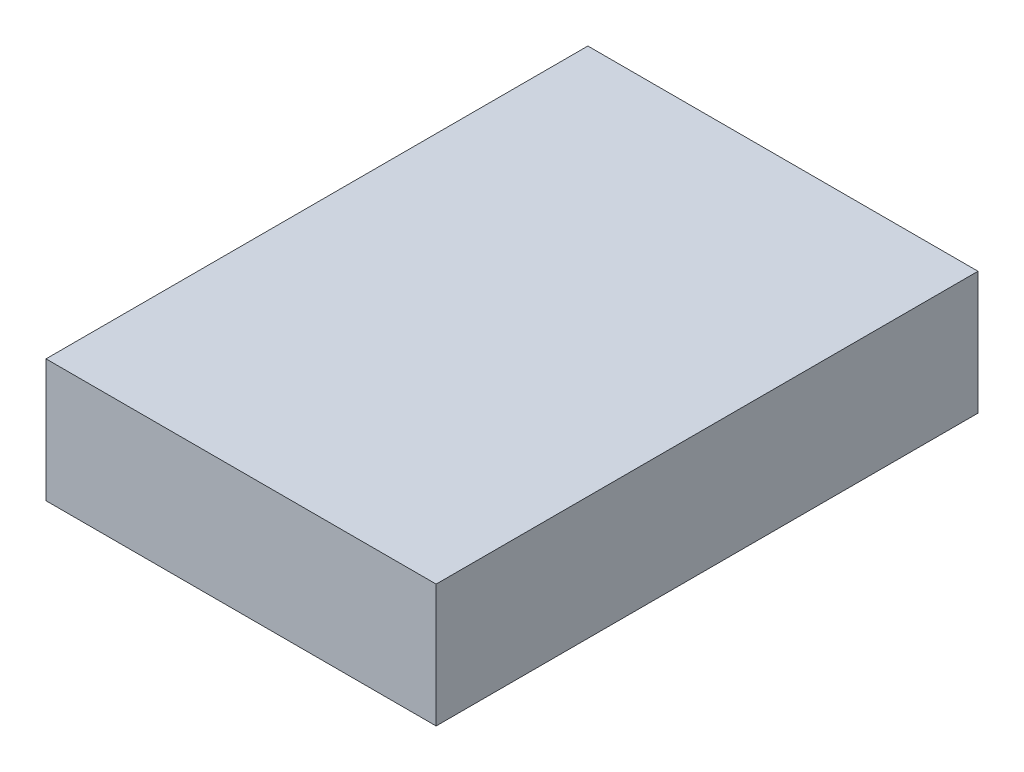
ISO-10303-21;
HEADER;
FILE_DESCRIPTION(('STEP AP214'),'2;1');
FILE_NAME('part.step','',(''),(''),'','','');
FILE_SCHEMA(('AUTOMOTIVE_DESIGN { 1 0 10303 214 1 1 1 1 }'));
ENDSEC;
DATA;
#1=APPLICATION_CONTEXT('core data for automotive mechanical design processes');
#2=APPLICATION_PROTOCOL_DEFINITION('international standard','automotive_design',2000,#1);
#3=PRODUCT_CONTEXT('',#1,'mechanical');
#4=PRODUCT('Part','Part','',(#3));
#5=PRODUCT_RELATED_PRODUCT_CATEGORY('part','',(#4));
#6=PRODUCT_DEFINITION_FORMATION('','',#4);
#7=PRODUCT_DEFINITION_CONTEXT('part definition',#1,'design');
#8=PRODUCT_DEFINITION('design','',#6,#7);
#9=PRODUCT_DEFINITION_SHAPE('','',#8);
#10=(LENGTH_UNIT() NAMED_UNIT(*) SI_UNIT(.MILLI.,.METRE.));
#11=(NAMED_UNIT(*) PLANE_ANGLE_UNIT() SI_UNIT($,.RADIAN.));
#12=(NAMED_UNIT(*) SI_UNIT($,.STERADIAN.) SOLID_ANGLE_UNIT());
#13=UNCERTAINTY_MEASURE_WITH_UNIT(LENGTH_MEASURE(1.E-05),#10,'distance_accuracy_value','');
#14=(GEOMETRIC_REPRESENTATION_CONTEXT(3) GLOBAL_UNCERTAINTY_ASSIGNED_CONTEXT((#13)) GLOBAL_UNIT_ASSIGNED_CONTEXT((#10,
#11,#12)) REPRESENTATION_CONTEXT('',''));
#15=CARTESIAN_POINT('',(0.,0.,0.));
#16=DIRECTION('',(0.,0.,1.));
#17=DIRECTION('',(1.,0.,0.));
#18=AXIS2_PLACEMENT_3D('',#15,#16,#17);
#19=CARTESIAN_POINT('',(-8.64400914634651,5.67,-12.6513582877436));
#20=DIRECTION('',(1.,0.,0.));
#21=DIRECTION('',(0.,0.,-1.));
#22=AXIS2_PLACEMENT_3D('',#19,#20,#21);
#23=PLANE('',#22);
#24=DIRECTION('',(0.,0.,1.));
#25=VECTOR('',#24,1.);
#26=CARTESIAN_POINT('',(-8.64400914634651,0.,-12.6513582877436));
#27=LINE('',#26,#25);
#28=CARTESIAN_POINT('',(-8.64400914634651,0.,-12.6513582877436));
#29=VERTEX_POINT('',#28);
#30=CARTESIAN_POINT('',(-8.64400914634651,0.,12.3486417122564));
#31=VERTEX_POINT('',#30);
#32=EDGE_CURVE('E104',#29,#31,#27,.T.);
#33=ORIENTED_EDGE('',*,*,#32,.T.);
#34=DIRECTION('',(0.,-1.,0.));
#35=VECTOR('',#34,1.);
#36=CARTESIAN_POINT('',(-8.64400914634651,5.67,12.3486417122564));
#37=LINE('',#36,#35);
#38=CARTESIAN_POINT('',(-8.64400914634651,5.67,12.3486417122564));
#39=VERTEX_POINT('',#38);
#40=EDGE_CURVE('E11',#39,#31,#37,.T.);
#41=ORIENTED_EDGE('',*,*,#40,.F.);
#42=DIRECTION('',(0.,0.,1.));
#43=VECTOR('',#42,1.);
#44=CARTESIAN_POINT('',(-8.64400914634651,5.67,-12.6513582877436));
#45=LINE('',#44,#43);
#46=CARTESIAN_POINT('',(-8.64400914634651,5.67,-12.6513582877436));
#47=VERTEX_POINT('',#46);
#48=EDGE_CURVE('E92',#47,#39,#45,.T.);
#49=ORIENTED_EDGE('',*,*,#48,.F.);
#50=DIRECTION('',(0.,-1.,0.));
#51=VECTOR('',#50,1.);
#52=CARTESIAN_POINT('',(-8.64400914634651,5.67,-12.6513582877436));
#53=LINE('',#52,#51);
#54=EDGE_CURVE('E100',#47,#29,#53,.T.);
#55=ORIENTED_EDGE('',*,*,#54,.T.);
#56=EDGE_LOOP('',(#33,#41,#49,#55));
#57=FACE_BOUND('',#56,.T.);
#58=ADVANCED_FACE('F41',(#57),#23,.F.);
#59=CARTESIAN_POINT('',(-8.64400914634651,5.67,12.3486417122564));
#60=DIRECTION('',(0.,0.,-1.));
#61=DIRECTION('',(-1.,0.,0.));
#62=AXIS2_PLACEMENT_3D('',#59,#60,#61);
#63=PLANE('',#62);
#64=DIRECTION('',(1.,0.,0.));
#65=VECTOR('',#64,1.);
#66=CARTESIAN_POINT('',(-8.64400914634651,0.,12.3486417122564));
#67=LINE('',#66,#65);
#68=CARTESIAN_POINT('',(9.35599085365349,0.,12.3486417122564));
#69=VERTEX_POINT('',#68);
#70=EDGE_CURVE('E96',#31,#69,#67,.T.);
#71=ORIENTED_EDGE('',*,*,#70,.T.);
#72=DIRECTION('',(0.,-1.,0.));
#73=VECTOR('',#72,1.);
#74=CARTESIAN_POINT('',(9.35599085365349,5.67,12.3486417122564));
#75=LINE('',#74,#73);
#76=CARTESIAN_POINT('',(9.35599085365349,5.67,12.3486417122564));
#77=VERTEX_POINT('',#76);
#78=EDGE_CURVE('E49',#77,#69,#75,.T.);
#79=ORIENTED_EDGE('',*,*,#78,.F.);
#80=DIRECTION('',(1.,0.,0.));
#81=VECTOR('',#80,1.);
#82=CARTESIAN_POINT('',(-8.64400914634651,5.67,12.3486417122564));
#83=LINE('',#82,#81);
#84=EDGE_CURVE('E87',#39,#77,#83,.T.);
#85=ORIENTED_EDGE('',*,*,#84,.F.);
#86=ORIENTED_EDGE('',*,*,#40,.T.);
#87=EDGE_LOOP('',(#71,#79,#85,#86));
#88=FACE_BOUND('',#87,.T.);
#89=ADVANCED_FACE('F95',(#88),#63,.F.);
#90=CARTESIAN_POINT('',(9.35599085365348,5.67,-12.6513582877436));
#91=DIRECTION('',(-1.,0.,0.));
#92=DIRECTION('',(0.,0.,1.));
#93=AXIS2_PLACEMENT_3D('',#90,#91,#92);
#94=PLANE('',#93);
#95=DIRECTION('',(0.,0.,-1.));
#96=VECTOR('',#95,1.);
#97=CARTESIAN_POINT('',(9.35599085365348,0.,-12.6513582877436));
#98=LINE('',#97,#96);
#99=CARTESIAN_POINT('',(9.35599085365348,0.,-12.6513582877436));
#100=VERTEX_POINT('',#99);
#101=EDGE_CURVE('E74',#69,#100,#98,.T.);
#102=ORIENTED_EDGE('',*,*,#101,.T.);
#103=DIRECTION('',(0.,-1.,0.));
#104=VECTOR('',#103,1.);
#105=CARTESIAN_POINT('',(9.35599085365348,5.67,-12.6513582877436));
#106=LINE('',#105,#104);
#107=CARTESIAN_POINT('',(9.35599085365348,5.67,-12.6513582877436));
#108=VERTEX_POINT('',#107);
#109=EDGE_CURVE('E97',#108,#100,#106,.T.);
#110=ORIENTED_EDGE('',*,*,#109,.F.);
#111=DIRECTION('',(0.,0.,-1.));
#112=VECTOR('',#111,1.);
#113=CARTESIAN_POINT('',(9.35599085365348,5.67,-12.6513582877436));
#114=LINE('',#113,#112);
#115=EDGE_CURVE('E90',#77,#108,#114,.T.);
#116=ORIENTED_EDGE('',*,*,#115,.F.);
#117=ORIENTED_EDGE('',*,*,#78,.T.);
#118=EDGE_LOOP('',(#102,#110,#116,#117));
#119=FACE_BOUND('',#118,.T.);
#120=ADVANCED_FACE('F98',(#119),#94,.F.);
#121=CARTESIAN_POINT('',(-8.64400914634651,5.67,-12.6513582877436));
#122=DIRECTION('',(0.,0.,1.));
#123=DIRECTION('',(1.,0.,0.));
#124=AXIS2_PLACEMENT_3D('',#121,#122,#123);
#125=PLANE('',#124);
#126=DIRECTION('',(-1.,0.,0.));
#127=VECTOR('',#126,1.);
#128=CARTESIAN_POINT('',(-8.64400914634651,0.,-12.6513582877436));
#129=LINE('',#128,#127);
#130=EDGE_CURVE('E80',#100,#29,#129,.T.);
#131=ORIENTED_EDGE('',*,*,#130,.T.);
#132=ORIENTED_EDGE('',*,*,#54,.F.);
#133=DIRECTION('',(-1.,0.,0.));
#134=VECTOR('',#133,1.);
#135=CARTESIAN_POINT('',(-8.64400914634651,5.67,-12.6513582877436));
#136=LINE('',#135,#134);
#137=EDGE_CURVE('E57',#108,#47,#136,.T.);
#138=ORIENTED_EDGE('',*,*,#137,.F.);
#139=ORIENTED_EDGE('',*,*,#109,.T.);
#140=EDGE_LOOP('',(#131,#132,#138,#139));
#141=FACE_BOUND('',#140,.T.);
#142=ADVANCED_FACE('F111',(#141),#125,.F.);
#143=CARTESIAN_POINT('',(0.,5.67,0.));
#144=DIRECTION('',(0.,1.,0.));
#145=DIRECTION('',(0.,0.,1.));
#146=AXIS2_PLACEMENT_3D('',#143,#144,#145);
#147=PLANE('',#146);
#148=ORIENTED_EDGE('',*,*,#48,.T.);
#149=ORIENTED_EDGE('',*,*,#84,.T.);
#150=ORIENTED_EDGE('',*,*,#115,.T.);
#151=ORIENTED_EDGE('',*,*,#137,.T.);
#152=EDGE_LOOP('',(#148,#149,#150,#151));
#153=FACE_BOUND('',#152,.T.);
#154=ADVANCED_FACE('F88',(#153),#147,.T.);
#155=CARTESIAN_POINT('',(0.,0.,0.));
#156=DIRECTION('',(0.,1.,0.));
#157=DIRECTION('',(0.,0.,1.));
#158=AXIS2_PLACEMENT_3D('',#155,#156,#157);
#159=PLANE('',#158);
#160=ORIENTED_EDGE('',*,*,#32,.F.);
#161=ORIENTED_EDGE('',*,*,#130,.F.);
#162=ORIENTED_EDGE('',*,*,#101,.F.);
#163=ORIENTED_EDGE('',*,*,#70,.F.);
#164=EDGE_LOOP('',(#160,#161,#162,#163));
#165=FACE_BOUND('',#164,.T.);
#166=ADVANCED_FACE('F114',(#165),#159,.F.);
#167=CLOSED_SHELL('',(#58,#89,#120,#142,#154,#166));
#168=MANIFOLD_SOLID_BREP('B2',#167);
#169=ADVANCED_BREP_SHAPE_REPRESENTATION('',(#18,#168),#14);
#170=SHAPE_DEFINITION_REPRESENTATION(#9,#169);
ENDSEC;
END-ISO-10303-21;
